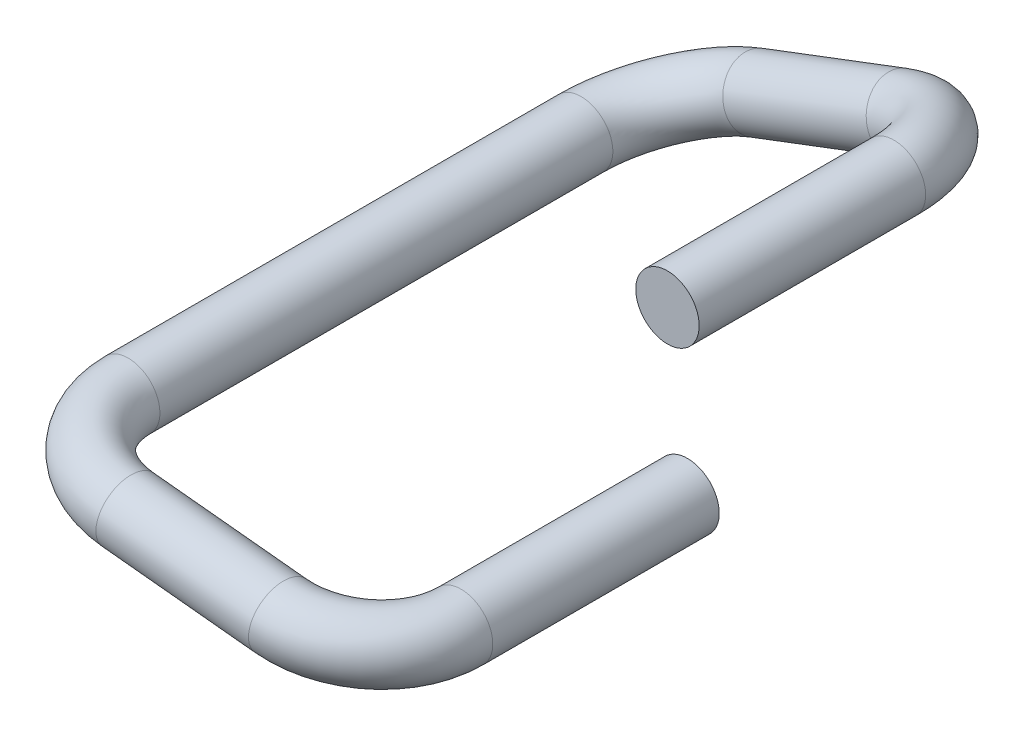
ISO-10303-21;
HEADER;
FILE_DESCRIPTION(('STEP AP214'),'2;1');
FILE_NAME('part.step','',(''),(''),'','','');
FILE_SCHEMA(('AUTOMOTIVE_DESIGN { 1 0 10303 214 1 1 1 1 }'));
ENDSEC;
DATA;
#1=APPLICATION_CONTEXT('core data for automotive mechanical design processes');
#2=APPLICATION_PROTOCOL_DEFINITION('international standard','automotive_design',2000,#1);
#3=PRODUCT_CONTEXT('',#1,'mechanical');
#4=PRODUCT('Part','Part','',(#3));
#5=PRODUCT_RELATED_PRODUCT_CATEGORY('part','',(#4));
#6=PRODUCT_DEFINITION_FORMATION('','',#4);
#7=PRODUCT_DEFINITION_CONTEXT('part definition',#1,'design');
#8=PRODUCT_DEFINITION('design','',#6,#7);
#9=PRODUCT_DEFINITION_SHAPE('','',#8);
#10=(LENGTH_UNIT() NAMED_UNIT(*) SI_UNIT(.MILLI.,.METRE.));
#11=(NAMED_UNIT(*) PLANE_ANGLE_UNIT() SI_UNIT($,.RADIAN.));
#12=(NAMED_UNIT(*) SI_UNIT($,.STERADIAN.) SOLID_ANGLE_UNIT());
#13=UNCERTAINTY_MEASURE_WITH_UNIT(LENGTH_MEASURE(1.E-05),#10,'distance_accuracy_value','');
#14=(GEOMETRIC_REPRESENTATION_CONTEXT(3) GLOBAL_UNCERTAINTY_ASSIGNED_CONTEXT((#13)) GLOBAL_UNIT_ASSIGNED_CONTEXT((#10,
#11,#12)) REPRESENTATION_CONTEXT('',''));
#15=CARTESIAN_POINT('',(0.,0.,0.));
#16=DIRECTION('',(0.,0.,1.));
#17=DIRECTION('',(1.,0.,0.));
#18=AXIS2_PLACEMENT_3D('',#15,#16,#17);
#19=CARTESIAN_POINT('',(6.5,0.,0.));
#20=DIRECTION('',(0.,0.,1.));
#21=DIRECTION('',(1.,0.,0.));
#22=AXIS2_PLACEMENT_3D('',#19,#20,#21);
#23=PLANE('',#22);
#24=CARTESIAN_POINT('',(6.5,0.,0.));
#25=DIRECTION('',(0.,0.,1.));
#26=DIRECTION('',(1.,0.,0.));
#27=AXIS2_PLACEMENT_3D('',#24,#25,#26);
#28=CIRCLE('',#27,0.35);
#29=CARTESIAN_POINT('',(6.15,0.,0.));
#30=VERTEX_POINT('',#29);
#31=EDGE_CURVE('E11',#30,#30,#28,.T.);
#32=ORIENTED_EDGE('',*,*,#31,.F.);
#33=EDGE_LOOP('',(#32));
#34=FACE_BOUND('',#33,.T.);
#35=ADVANCED_FACE('F17',(#34),#23,.F.);
#36=CARTESIAN_POINT('',(6.27851787087894,1.68232379316638,0.));
#37=DIRECTION('',(0.,0.,1.));
#38=DIRECTION('',(1.,0.,0.));
#39=AXIS2_PLACEMENT_3D('',#36,#37,#38);
#40=PLANE('',#39);
#41=CARTESIAN_POINT('',(6.27851787087894,1.68232379316638,0.));
#42=DIRECTION('',(0.,0.,1.));
#43=DIRECTION('',(0.600084751723605,0.799936429192232,0.));
#44=AXIS2_PLACEMENT_3D('',#41,#42,#43);
#45=CIRCLE('',#44,0.35);
#46=CARTESIAN_POINT('',(6.06848820777568,1.4023460429491,0.));
#47=VERTEX_POINT('',#46);
#48=EDGE_CURVE('E221',#47,#47,#45,.T.);
#49=ORIENTED_EDGE('',*,*,#48,.T.);
#50=EDGE_LOOP('',(#49));
#51=FACE_BOUND('',#50,.T.);
#52=ADVANCED_FACE('F237',(#51),#40,.T.);
#53=CARTESIAN_POINT('',(6.5,0.,0.));
#54=DIRECTION('',(0.,0.,1.));
#55=DIRECTION('',(1.,0.,0.));
#56=AXIS2_PLACEMENT_3D('',#53,#54,#55);
#57=CYLINDRICAL_SURFACE('',#56,0.35);
#58=CARTESIAN_POINT('',(6.5,0.,2.5));
#59=DIRECTION('',(0.,0.,1.));
#60=DIRECTION('',(1.,0.,0.));
#61=AXIS2_PLACEMENT_3D('',#58,#59,#60);
#62=CIRCLE('',#61,0.35);
#63=CARTESIAN_POINT('',(6.15,0.,2.5));
#64=VERTEX_POINT('',#63);
#65=CARTESIAN_POINT('',(6.15178004697375,0.0352542807953275,2.5));
#66=VERTEX_POINT('',#65);
#67=EDGE_CURVE('E151',#64,#66,#62,.T.);
#68=ORIENTED_EDGE('',*,*,#67,.F.);
#69=DIRECTION('',(0.,0.,-1.));
#70=VECTOR('',#69,1.);
#71=CARTESIAN_POINT('',(6.15,0.,0.));
#72=LINE('',#71,#70);
#73=EDGE_CURVE('E25',#64,#30,#72,.T.);
#74=ORIENTED_EDGE('',*,*,#73,.T.);
#75=ORIENTED_EDGE('',*,*,#31,.T.);
#76=ORIENTED_EDGE('',*,*,#73,.F.);
#77=CARTESIAN_POINT('',(6.5,0.,2.5));
#78=DIRECTION('',(0.,0.,1.));
#79=DIRECTION('',(1.,0.,0.));
#80=AXIS2_PLACEMENT_3D('',#77,#78,#79);
#81=CIRCLE('',#80,0.35);
#82=EDGE_CURVE('E170',#66,#64,#81,.T.);
#83=ORIENTED_EDGE('',*,*,#82,.F.);
#84=EDGE_LOOP('',(#68,#74,#75,#76,#83));
#85=FACE_BOUND('',#84,.T.);
#86=ADVANCED_FACE('F180',(#85),#57,.T.);
#87=CARTESIAN_POINT('',(5.50508584849643,0.100726516558078,2.5));
#88=DIRECTION('',(-0.100726516558078,-0.994914151503573,0.));
#89=DIRECTION('',(0.,0.,-1.));
#90=AXIS2_PLACEMENT_3D('',#87,#88,#89);
#91=TOROIDAL_SURFACE('',#90,1.,0.35);
#92=CARTESIAN_POINT('',(5.50508584849643,0.100726516558078,3.5));
#93=DIRECTION('',(-0.994914151503573,0.100726516558078,0.));
#94=DIRECTION('',(0.0101458311379248,0.100214236755291,0.994914151503573));
#95=AXIS2_PLACEMENT_3D('',#92,#93,#94);
#96=CIRCLE('',#95,0.35);
#97=CARTESIAN_POINT('',(5.50153480759815,0.0656515336937263,3.15178004697375));
#98=VERTEX_POINT('',#97);
#99=CARTESIAN_POINT('',(5.50508584849643,0.100726516558078,3.15));
#100=VERTEX_POINT('',#99);
#101=EDGE_CURVE('E162',#98,#100,#96,.T.);
#102=ORIENTED_EDGE('',*,*,#101,.F.);
#103=CARTESIAN_POINT('',(5.50508584849643,0.100726516558078,3.5));
#104=DIRECTION('',(-0.994914151503573,0.100726516558078,0.));
#105=DIRECTION('',(0.0101458311379248,0.100214236755291,0.994914151503573));
#106=AXIS2_PLACEMENT_3D('',#103,#104,#105);
#107=CIRCLE('',#106,0.35);
#108=EDGE_CURVE('E163',#100,#98,#107,.T.);
#109=ORIENTED_EDGE('',*,*,#108,.F.);
#110=CARTESIAN_POINT('',(5.50508584849643,0.100726516558078,2.5));
#111=DIRECTION('',(0.100726516558078,0.994914151503573,0.));
#112=DIRECTION('',(0.,0.,-1.));
#113=AXIS2_PLACEMENT_3D('',#110,#111,#112);
#114=CIRCLE('',#113,0.65);
#115=EDGE_CURVE('E166',#100,#66,#114,.T.);
#116=ORIENTED_EDGE('',*,*,#115,.T.);
#117=ORIENTED_EDGE('',*,*,#82,.T.);
#118=ORIENTED_EDGE('',*,*,#67,.T.);
#119=ORIENTED_EDGE('',*,*,#115,.F.);
#120=EDGE_LOOP('',(#102,#109,#116,#117,#118,#119));
#121=FACE_BOUND('',#120,.T.);
#122=ADVANCED_FACE('F178',(#121),#91,.T.);
#123=CARTESIAN_POINT('',(5.50508584849643,0.100726516558078,3.5));
#124=DIRECTION('',(-0.994914151503573,0.100726516558078,0.));
#125=DIRECTION('',(0.0101458311379248,0.100214236755291,0.994914151503573));
#126=AXIS2_PLACEMENT_3D('',#123,#124,#125);
#127=CYLINDRICAL_SURFACE('',#126,0.35);
#128=CARTESIAN_POINT('',(3.82053200641893,0.271273131269069,3.5));
#129=DIRECTION('',(-0.994914151503573,0.100726516558078,0.));
#130=DIRECTION('',(0.0101458311379248,0.100214236755291,0.994914151503573));
#131=AXIS2_PLACEMENT_3D('',#128,#129,#130);
#132=CIRCLE('',#131,0.35);
#133=CARTESIAN_POINT('',(3.81698096552066,0.236198148404717,3.15178004697375));
#134=VERTEX_POINT('',#133);
#135=CARTESIAN_POINT('',(3.82053200641893,0.271273131269069,3.15));
#136=VERTEX_POINT('',#135);
#137=EDGE_CURVE('E155',#134,#136,#132,.T.);
#138=ORIENTED_EDGE('',*,*,#137,.F.);
#139=DIRECTION('',(0.994914151503573,-0.100726516558078,0.));
#140=VECTOR('',#139,1.);
#141=CARTESIAN_POINT('',(5.50153480759815,0.0656515336937261,3.15178004697375));
#142=LINE('',#141,#140);
#143=EDGE_CURVE('E158',#134,#98,#142,.T.);
#144=ORIENTED_EDGE('',*,*,#143,.T.);
#145=ORIENTED_EDGE('',*,*,#101,.T.);
#146=ORIENTED_EDGE('',*,*,#108,.T.);
#147=ORIENTED_EDGE('',*,*,#143,.F.);
#148=CARTESIAN_POINT('',(3.82053200641893,0.271273131269069,3.5));
#149=DIRECTION('',(-0.994914151503573,0.100726516558078,0.));
#150=DIRECTION('',(0.0101458311379248,0.100214236755291,0.994914151503573));
#151=AXIS2_PLACEMENT_3D('',#148,#149,#150);
#152=CIRCLE('',#151,0.35);
#153=EDGE_CURVE('E147',#136,#134,#152,.T.);
#154=ORIENTED_EDGE('',*,*,#153,.F.);
#155=EDGE_LOOP('',(#138,#144,#145,#146,#147,#154));
#156=FACE_BOUND('',#155,.T.);
#157=ADVANCED_FACE('F184',(#156),#127,.T.);
#158=CARTESIAN_POINT('',(3.82053200641893,0.271273131269069,2.5));
#159=DIRECTION('',(-0.100726516558078,-0.994914151503573,0.));
#160=DIRECTION('',(0.,0.,-1.));
#161=AXIS2_PLACEMENT_3D('',#158,#159,#160);
#162=TOROIDAL_SURFACE('',#161,1.,0.35);
#163=CARTESIAN_POINT('',(2.82561785491536,0.371999647827147,2.5));
#164=DIRECTION('',(0.,0.,-1.));
#165=DIRECTION('',(-0.97970833772415,0.200428473510582,0.));
#166=AXIS2_PLACEMENT_3D('',#163,#164,#165);
#167=CIRCLE('',#166,0.35);
#168=CARTESIAN_POINT('',(3.16851577311881,0.301849682098443,2.5));
#169=VERTEX_POINT('',#168);
#170=CARTESIAN_POINT('',(3.17383780794161,0.336745367031819,2.5));
#171=VERTEX_POINT('',#170);
#172=EDGE_CURVE('E198',#169,#171,#167,.T.);
#173=ORIENTED_EDGE('',*,*,#172,.F.);
#174=CARTESIAN_POINT('',(2.82561785491536,0.371999647827147,2.5));
#175=DIRECTION('',(0.,0.,-1.));
#176=DIRECTION('',(-0.97970833772415,0.200428473510582,0.));
#177=AXIS2_PLACEMENT_3D('',#174,#175,#176);
#178=CIRCLE('',#177,0.35);
#179=EDGE_CURVE('E148',#171,#169,#178,.T.);
#180=ORIENTED_EDGE('',*,*,#179,.F.);
#181=CARTESIAN_POINT('',(3.82053200641893,0.271273131269069,2.5));
#182=DIRECTION('',(0.100726516558078,0.994914151503573,0.));
#183=DIRECTION('',(0.,0.,-1.));
#184=AXIS2_PLACEMENT_3D('',#181,#182,#183);
#185=CIRCLE('',#184,0.65);
#186=EDGE_CURVE('E143',#171,#136,#185,.T.);
#187=ORIENTED_EDGE('',*,*,#186,.T.);
#188=ORIENTED_EDGE('',*,*,#153,.T.);
#189=ORIENTED_EDGE('',*,*,#137,.T.);
#190=ORIENTED_EDGE('',*,*,#186,.F.);
#191=EDGE_LOOP('',(#173,#180,#187,#188,#189,#190));
#192=FACE_BOUND('',#191,.T.);
#193=ADVANCED_FACE('F312',(#192),#162,.T.);
#194=CARTESIAN_POINT('',(2.82561785491536,0.371999647827147,2.5));
#195=DIRECTION('',(0.,0.,-1.));
#196=DIRECTION('',(-0.97970833772415,0.200428473510582,0.));
#197=AXIS2_PLACEMENT_3D('',#194,#195,#196);
#198=CYLINDRICAL_SURFACE('',#197,0.35);
#199=CARTESIAN_POINT('',(2.82561785491536,0.371999647827147,-2.5));
#200=DIRECTION('',(0.,0.,-1.));
#201=DIRECTION('',(-0.97970833772415,0.200428473510582,0.));
#202=AXIS2_PLACEMENT_3D('',#199,#200,#201);
#203=CIRCLE('',#202,0.35);
#204=CARTESIAN_POINT('',(3.16851577311881,0.301849682098443,-2.5));
#205=VERTEX_POINT('',#204);
#206=CARTESIAN_POINT('',(3.15284802148136,0.496178623862499,-2.5));
#207=VERTEX_POINT('',#206);
#208=EDGE_CURVE('E142',#205,#207,#203,.T.);
#209=ORIENTED_EDGE('',*,*,#208,.F.);
#210=DIRECTION('',(0.,0.,1.));
#211=VECTOR('',#210,1.);
#212=CARTESIAN_POINT('',(3.16851577311882,0.301849682098443,2.5));
#213=LINE('',#212,#211);
#214=EDGE_CURVE('E201',#205,#169,#213,.T.);
#215=ORIENTED_EDGE('',*,*,#214,.T.);
#216=ORIENTED_EDGE('',*,*,#172,.T.);
#217=ORIENTED_EDGE('',*,*,#179,.T.);
#218=ORIENTED_EDGE('',*,*,#214,.F.);
#219=CARTESIAN_POINT('',(2.82561785491536,0.371999647827147,-2.5));
#220=DIRECTION('',(0.,0.,-1.));
#221=DIRECTION('',(-0.97970833772415,0.200428473510582,0.));
#222=AXIS2_PLACEMENT_3D('',#219,#220,#221);
#223=CIRCLE('',#222,0.35);
#224=EDGE_CURVE('E138',#207,#205,#223,.T.);
#225=ORIENTED_EDGE('',*,*,#224,.F.);
#226=EDGE_LOOP('',(#209,#215,#216,#217,#218,#225));
#227=FACE_BOUND('',#226,.T.);
#228=ADVANCED_FACE('F307',(#227),#198,.T.);
#229=CARTESIAN_POINT('',(3.76056118796107,0.726796722213867,-2.5));
#230=DIRECTION('',(0.354797074386721,-0.934943333045711,0.));
#231=DIRECTION('',(0.,0.,-1.));
#232=AXIS2_PLACEMENT_3D('',#229,#230,#231);
#233=TOROIDAL_SURFACE('',#232,1.,0.35);
#234=CARTESIAN_POINT('',(3.76056118796108,0.726796722213867,-3.5));
#235=DIRECTION('',(0.934943333045711,0.354797074386721,0.));
#236=DIRECTION('',(-0.189811793000273,0.500182451351406,-0.84486034265914));
#237=AXIS2_PLACEMENT_3D('',#234,#235,#236);
#238=CIRCLE('',#237,0.35);
#239=CARTESIAN_POINT('',(3.82699531551117,0.551732864240875,-3.2042988800693));
#240=VERTEX_POINT('',#239);
#241=CARTESIAN_POINT('',(3.76056118796108,0.726796722213868,-3.15));
#242=VERTEX_POINT('',#241);
#243=EDGE_CURVE('E115',#240,#242,#238,.T.);
#244=ORIENTED_EDGE('',*,*,#243,.F.);
#245=CARTESIAN_POINT('',(3.76056118796108,0.726796722213867,-3.5));
#246=DIRECTION('',(0.934943333045711,0.354797074386721,0.));
#247=DIRECTION('',(-0.189811793000273,0.500182451351406,-0.84486034265914));
#248=AXIS2_PLACEMENT_3D('',#245,#246,#247);
#249=CIRCLE('',#248,0.35);
#250=EDGE_CURVE('E108',#242,#240,#249,.T.);
#251=ORIENTED_EDGE('',*,*,#250,.F.);
#252=CARTESIAN_POINT('',(3.76056118796107,0.726796722213867,-2.5));
#253=DIRECTION('',(-0.354797074386721,0.934943333045711,0.));
#254=DIRECTION('',(0.,0.,-1.));
#255=AXIS2_PLACEMENT_3D('',#252,#253,#254);
#256=CIRCLE('',#255,0.65);
#257=EDGE_CURVE('E119',#242,#207,#256,.T.);
#258=ORIENTED_EDGE('',*,*,#257,.T.);
#259=ORIENTED_EDGE('',*,*,#224,.T.);
#260=ORIENTED_EDGE('',*,*,#208,.T.);
#261=ORIENTED_EDGE('',*,*,#257,.F.);
#262=EDGE_LOOP('',(#244,#251,#258,#259,#260,#261));
#263=FACE_BOUND('',#262,.T.);
#264=ADVANCED_FACE('F121',(#263),#233,.T.);
#265=CARTESIAN_POINT('',(3.76056118796108,0.726796722213867,-3.5));
#266=DIRECTION('',(0.934943333045711,0.35479707438672,0.));
#267=DIRECTION('',(-0.189811793000273,0.500182451351407,-0.84486034265914));
#268=AXIS2_PLACEMENT_3D('',#265,#266,#267);
#269=CYLINDRICAL_SURFACE('',#268,0.35);
#270=CARTESIAN_POINT('',(5.34357453783324,1.32752671877966,-3.5));
#271=DIRECTION('',(0.934943333045711,0.354797074386721,0.));
#272=DIRECTION('',(-0.189811793000273,0.500182451351407,-0.84486034265914));
#273=AXIS2_PLACEMENT_3D('',#270,#271,#272);
#274=CIRCLE('',#273,0.35);
#275=CARTESIAN_POINT('',(5.41000866538333,1.15246286080667,-3.2042988800693));
#276=VERTEX_POINT('',#275);
#277=CARTESIAN_POINT('',(5.34357453783324,1.32752671877966,-3.15));
#278=VERTEX_POINT('',#277);
#279=EDGE_CURVE('E124',#276,#278,#274,.T.);
#280=ORIENTED_EDGE('',*,*,#279,.F.);
#281=DIRECTION('',(-0.934943333045712,-0.35479707438672,0.));
#282=VECTOR('',#281,1.);
#283=CARTESIAN_POINT('',(3.82699531551117,0.551732864240875,-3.2042988800693));
#284=LINE('',#283,#282);
#285=EDGE_CURVE('E114',#276,#240,#284,.T.);
#286=ORIENTED_EDGE('',*,*,#285,.T.);
#287=ORIENTED_EDGE('',*,*,#243,.T.);
#288=ORIENTED_EDGE('',*,*,#250,.T.);
#289=ORIENTED_EDGE('',*,*,#285,.F.);
#290=CARTESIAN_POINT('',(5.34357453783324,1.32752671877966,-3.5));
#291=DIRECTION('',(0.934943333045711,0.354797074386721,0.));
#292=DIRECTION('',(-0.189811793000273,0.500182451351407,-0.84486034265914));
#293=AXIS2_PLACEMENT_3D('',#290,#291,#292);
#294=CIRCLE('',#293,0.35);
#295=EDGE_CURVE('E132',#278,#276,#294,.T.);
#296=ORIENTED_EDGE('',*,*,#295,.F.);
#297=EDGE_LOOP('',(#280,#286,#287,#288,#289,#296));
#298=FACE_BOUND('',#297,.T.);
#299=ADVANCED_FACE('F111',(#298),#269,.T.);
#300=CARTESIAN_POINT('',(5.34357453783323,1.32752671877966,-2.5));
#301=DIRECTION('',(0.354797074386721,-0.934943333045711,0.));
#302=DIRECTION('',(0.,0.,-1.));
#303=AXIS2_PLACEMENT_3D('',#300,#301,#302);
#304=TOROIDAL_SURFACE('',#303,1.,0.35);
#305=CARTESIAN_POINT('',(6.27851787087894,1.68232379316638,-2.5));
#306=DIRECTION('',(0.,0.,1.));
#307=DIRECTION('',(0.600084751723605,0.799936429192232,0.));
#308=AXIS2_PLACEMENT_3D('',#305,#306,#307);
#309=CIRCLE('',#308,0.35);
#310=CARTESIAN_POINT('',(6.06848820777568,1.4023460429491,-2.5));
#311=VERTEX_POINT('',#310);
#312=CARTESIAN_POINT('',(5.95128770431294,1.55814481713103,-2.5));
#313=VERTEX_POINT('',#312);
#314=EDGE_CURVE('E191',#311,#313,#309,.T.);
#315=ORIENTED_EDGE('',*,*,#314,.F.);
#316=CARTESIAN_POINT('',(6.27851787087894,1.68232379316638,-2.5));
#317=DIRECTION('',(0.,0.,1.));
#318=DIRECTION('',(0.600084751723605,0.799936429192232,0.));
#319=AXIS2_PLACEMENT_3D('',#316,#317,#318);
#320=CIRCLE('',#319,0.35);
#321=EDGE_CURVE('E193',#313,#311,#320,.T.);
#322=ORIENTED_EDGE('',*,*,#321,.F.);
#323=CARTESIAN_POINT('',(5.34357453783323,1.32752671877966,-2.5));
#324=DIRECTION('',(-0.354797074386721,0.934943333045711,0.));
#325=DIRECTION('',(0.,0.,-1.));
#326=AXIS2_PLACEMENT_3D('',#323,#324,#325);
#327=CIRCLE('',#326,0.65);
#328=EDGE_CURVE('E196',#313,#278,#327,.T.);
#329=ORIENTED_EDGE('',*,*,#328,.T.);
#330=ORIENTED_EDGE('',*,*,#295,.T.);
#331=ORIENTED_EDGE('',*,*,#279,.T.);
#332=ORIENTED_EDGE('',*,*,#328,.F.);
#333=EDGE_LOOP('',(#315,#322,#329,#330,#331,#332));
#334=FACE_BOUND('',#333,.T.);
#335=ADVANCED_FACE('F229',(#334),#304,.T.);
#336=CARTESIAN_POINT('',(6.27851787087894,1.68232379316638,-2.5));
#337=DIRECTION('',(0.,0.,1.));
#338=DIRECTION('',(0.600084751723605,0.799936429192232,0.));
#339=AXIS2_PLACEMENT_3D('',#336,#337,#338);
#340=CYLINDRICAL_SURFACE('',#339,0.35);
#341=ORIENTED_EDGE('',*,*,#48,.F.);
#342=DIRECTION('',(0.,0.,-1.));
#343=VECTOR('',#342,1.);
#344=CARTESIAN_POINT('',(6.06848820777568,1.4023460429491,-2.5));
#345=LINE('',#344,#343);
#346=EDGE_CURVE('E218',#47,#311,#345,.T.);
#347=ORIENTED_EDGE('',*,*,#346,.T.);
#348=ORIENTED_EDGE('',*,*,#314,.T.);
#349=ORIENTED_EDGE('',*,*,#321,.T.);
#350=ORIENTED_EDGE('',*,*,#346,.F.);
#351=EDGE_LOOP('',(#341,#347,#348,#349,#350));
#352=FACE_BOUND('',#351,.T.);
#353=ADVANCED_FACE('F234',(#352),#340,.T.);
#354=CLOSED_SHELL('',(#35,#52,#86,#122,#157,#193,#228,#264,#299,#335,#353));
#355=MANIFOLD_SOLID_BREP('B1',#354);
#356=ADVANCED_BREP_SHAPE_REPRESENTATION('',(#18,#355),#14);
#357=SHAPE_DEFINITION_REPRESENTATION(#9,#356);
ENDSEC;
END-ISO-10303-21;
